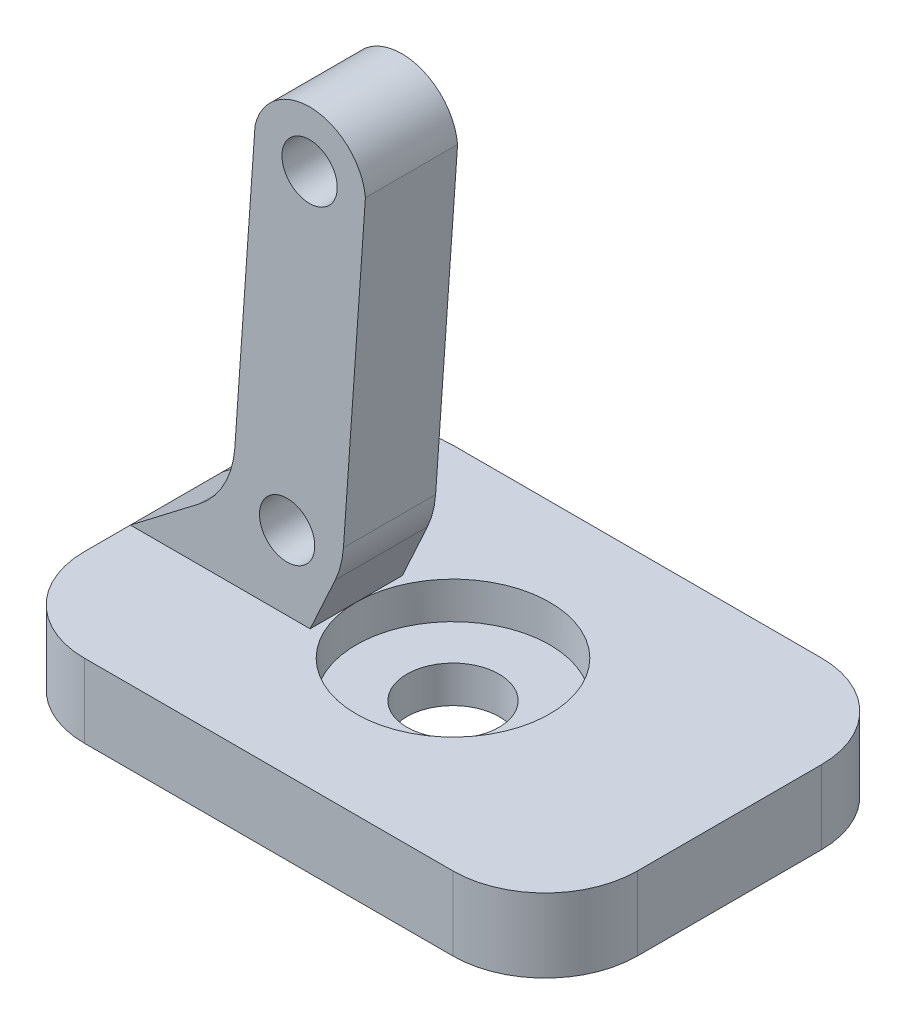
ISO-10303-21;
HEADER;
FILE_DESCRIPTION(('STEP AP214'),'2;1');
FILE_NAME('part.step','',(''),(''),'','','');
FILE_SCHEMA(('AUTOMOTIVE_DESIGN { 1 0 10303 214 1 1 1 1 }'));
ENDSEC;
DATA;
#1=APPLICATION_CONTEXT('core data for automotive mechanical design processes');
#2=APPLICATION_PROTOCOL_DEFINITION('international standard','automotive_design',2000,#1);
#3=PRODUCT_CONTEXT('',#1,'mechanical');
#4=PRODUCT('Part','Part','',(#3));
#5=PRODUCT_RELATED_PRODUCT_CATEGORY('part','',(#4));
#6=PRODUCT_DEFINITION_FORMATION('','',#4);
#7=PRODUCT_DEFINITION_CONTEXT('part definition',#1,'design');
#8=PRODUCT_DEFINITION('design','',#6,#7);
#9=PRODUCT_DEFINITION_SHAPE('','',#8);
#10=(LENGTH_UNIT() NAMED_UNIT(*) SI_UNIT(.MILLI.,.METRE.));
#11=(NAMED_UNIT(*) PLANE_ANGLE_UNIT() SI_UNIT($,.RADIAN.));
#12=(NAMED_UNIT(*) SI_UNIT($,.STERADIAN.) SOLID_ANGLE_UNIT());
#13=UNCERTAINTY_MEASURE_WITH_UNIT(LENGTH_MEASURE(1.E-05),#10,'distance_accuracy_value','');
#14=(GEOMETRIC_REPRESENTATION_CONTEXT(3) GLOBAL_UNCERTAINTY_ASSIGNED_CONTEXT((#13)) GLOBAL_UNIT_ASSIGNED_CONTEXT((#10,
#11,#12)) REPRESENTATION_CONTEXT('',''));
#15=CARTESIAN_POINT('',(0.,0.,0.));
#16=DIRECTION('',(0.,0.,1.));
#17=DIRECTION('',(1.,0.,0.));
#18=AXIS2_PLACEMENT_3D('',#15,#16,#17);
#19=CARTESIAN_POINT('',(0.,4.,0.));
#20=DIRECTION('',(0.,1.,0.));
#21=DIRECTION('',(0.,0.,1.));
#22=AXIS2_PLACEMENT_3D('',#19,#20,#21);
#23=PLANE('',#22);
#24=DIRECTION('',(0.,0.,-1.));
#25=VECTOR('',#24,1.);
#26=CARTESIAN_POINT('',(15.,4.,-10.));
#27=LINE('',#26,#25);
#28=CARTESIAN_POINT('',(15.,4.,5.));
#29=VERTEX_POINT('',#28);
#30=CARTESIAN_POINT('',(15.,4.,-5.));
#31=VERTEX_POINT('',#30);
#32=EDGE_CURVE('E197',#29,#31,#27,.T.);
#33=ORIENTED_EDGE('',*,*,#32,.T.);
#34=CARTESIAN_POINT('',(10.,4.,-5.));
#35=DIRECTION('',(0.,1.,0.));
#36=DIRECTION('',(0.,0.,1.));
#37=AXIS2_PLACEMENT_3D('',#34,#35,#36);
#38=CIRCLE('',#37,5.);
#39=CARTESIAN_POINT('',(10.,4.,-10.));
#40=VERTEX_POINT('',#39);
#41=EDGE_CURVE('E261',#31,#40,#38,.T.);
#42=ORIENTED_EDGE('',*,*,#41,.T.);
#43=DIRECTION('',(-1.,0.,0.));
#44=VECTOR('',#43,1.);
#45=CARTESIAN_POINT('',(-15.,4.,-10.));
#46=LINE('',#45,#44);
#47=CARTESIAN_POINT('',(-10.,4.,-10.));
#48=VERTEX_POINT('',#47);
#49=EDGE_CURVE('E200',#40,#48,#46,.T.);
#50=ORIENTED_EDGE('',*,*,#49,.T.);
#51=CARTESIAN_POINT('',(-10.,4.,-5.));
#52=DIRECTION('',(0.,1.,0.));
#53=DIRECTION('',(0.,0.,1.));
#54=AXIS2_PLACEMENT_3D('',#51,#52,#53);
#55=CIRCLE('',#54,5.);
#56=CARTESIAN_POINT('',(-15.,4.,-5.));
#57=VERTEX_POINT('',#56);
#58=EDGE_CURVE('E257',#48,#57,#55,.T.);
#59=ORIENTED_EDGE('',*,*,#58,.T.);
#60=DIRECTION('',(0.,0.,1.));
#61=VECTOR('',#60,1.);
#62=CARTESIAN_POINT('',(-15.,4.,-10.));
#63=LINE('',#62,#61);
#64=CARTESIAN_POINT('',(-15.,4.,-2.5));
#65=VERTEX_POINT('',#64);
#66=EDGE_CURVE('E205',#57,#65,#63,.T.);
#67=ORIENTED_EDGE('',*,*,#66,.T.);
#68=DIRECTION('',(1.,0.,0.));
#69=VECTOR('',#68,1.);
#70=CARTESIAN_POINT('',(-5.25,4.,-2.5));
#71=LINE('',#70,#69);
#72=CARTESIAN_POINT('',(-5.25,4.,-2.5));
#73=VERTEX_POINT('',#72);
#74=EDGE_CURVE('E306',#65,#73,#71,.T.);
#75=ORIENTED_EDGE('',*,*,#74,.T.);
#76=DIRECTION('',(0.,0.,-1.));
#77=VECTOR('',#76,1.);
#78=CARTESIAN_POINT('',(-5.25,4.,2.5));
#79=LINE('',#78,#77);
#80=CARTESIAN_POINT('',(-5.25,4.,0.));
#81=VERTEX_POINT('',#80);
#82=EDGE_CURVE('E209',#81,#73,#79,.T.);
#83=ORIENTED_EDGE('',*,*,#82,.F.);
#84=CARTESIAN_POINT('',(0.,4.,0.));
#85=DIRECTION('',(0.,1.,0.));
#86=DIRECTION('',(0.,0.,1.));
#87=AXIS2_PLACEMENT_3D('',#84,#85,#86);
#88=CIRCLE('',#87,5.25);
#89=EDGE_CURVE('E194',#81,#81,#88,.T.);
#90=ORIENTED_EDGE('',*,*,#89,.F.);
#91=CARTESIAN_POINT('',(-5.25,4.,2.5));
#92=VERTEX_POINT('',#91);
#93=EDGE_CURVE('E186',#92,#81,#79,.T.);
#94=ORIENTED_EDGE('',*,*,#93,.F.);
#95=DIRECTION('',(1.,0.,0.));
#96=VECTOR('',#95,1.);
#97=CARTESIAN_POINT('',(-5.25,4.,2.5));
#98=LINE('',#97,#96);
#99=CARTESIAN_POINT('',(-15.,4.,2.5));
#100=VERTEX_POINT('',#99);
#101=EDGE_CURVE('E276',#100,#92,#98,.T.);
#102=ORIENTED_EDGE('',*,*,#101,.F.);
#103=CARTESIAN_POINT('',(-15.,4.,5.));
#104=VERTEX_POINT('',#103);
#105=EDGE_CURVE('E204',#100,#104,#63,.T.);
#106=ORIENTED_EDGE('',*,*,#105,.T.);
#107=CARTESIAN_POINT('',(-10.,4.,5.));
#108=DIRECTION('',(0.,1.,0.));
#109=DIRECTION('',(0.,0.,1.));
#110=AXIS2_PLACEMENT_3D('',#107,#108,#109);
#111=CIRCLE('',#110,5.);
#112=CARTESIAN_POINT('',(-10.,4.,10.));
#113=VERTEX_POINT('',#112);
#114=EDGE_CURVE('E55',#104,#113,#111,.T.);
#115=ORIENTED_EDGE('',*,*,#114,.T.);
#116=DIRECTION('',(1.,0.,0.));
#117=VECTOR('',#116,1.);
#118=CARTESIAN_POINT('',(-15.,4.,10.));
#119=LINE('',#118,#117);
#120=CARTESIAN_POINT('',(10.,4.,10.));
#121=VERTEX_POINT('',#120);
#122=EDGE_CURVE('E207',#113,#121,#119,.T.);
#123=ORIENTED_EDGE('',*,*,#122,.T.);
#124=CARTESIAN_POINT('',(10.,4.,5.));
#125=DIRECTION('',(0.,1.,0.));
#126=DIRECTION('',(0.,0.,1.));
#127=AXIS2_PLACEMENT_3D('',#124,#125,#126);
#128=CIRCLE('',#127,5.);
#129=EDGE_CURVE('E259',#121,#29,#128,.T.);
#130=ORIENTED_EDGE('',*,*,#129,.T.);
#131=EDGE_LOOP('',(#33,#42,#50,#59,#67,#75,#83,#90,#94,#102,#106,#115,#123,#130));
#132=FACE_BOUND('',#131,.T.);
#133=ADVANCED_FACE('F33',(#132),#23,.T.);
#134=CARTESIAN_POINT('',(15.,4.,-10.));
#135=DIRECTION('',(-1.,0.,0.));
#136=DIRECTION('',(0.,0.,1.));
#137=AXIS2_PLACEMENT_3D('',#134,#135,#136);
#138=PLANE('',#137);
#139=DIRECTION('',(0.,0.,-1.));
#140=VECTOR('',#139,1.);
#141=CARTESIAN_POINT('',(15.,0.,-10.));
#142=LINE('',#141,#140);
#143=CARTESIAN_POINT('',(15.,0.,5.));
#144=VERTEX_POINT('',#143);
#145=CARTESIAN_POINT('',(15.,0.,-5.));
#146=VERTEX_POINT('',#145);
#147=EDGE_CURVE('E193',#144,#146,#142,.T.);
#148=ORIENTED_EDGE('',*,*,#147,.T.);
#149=DIRECTION('',(0.,-1.,0.));
#150=VECTOR('',#149,1.);
#151=CARTESIAN_POINT('',(15.,4.,-5.));
#152=LINE('',#151,#150);
#153=EDGE_CURVE('E254',#146,#31,#152,.F.);
#154=ORIENTED_EDGE('',*,*,#153,.T.);
#155=ORIENTED_EDGE('',*,*,#32,.F.);
#156=DIRECTION('',(0.,-1.,0.));
#157=VECTOR('',#156,1.);
#158=CARTESIAN_POINT('',(15.,4.,5.));
#159=LINE('',#158,#157);
#160=EDGE_CURVE('E251',#29,#144,#159,.T.);
#161=ORIENTED_EDGE('',*,*,#160,.T.);
#162=EDGE_LOOP('',(#148,#154,#155,#161));
#163=FACE_BOUND('',#162,.T.);
#164=ADVANCED_FACE('F290',(#163),#138,.F.);
#165=CARTESIAN_POINT('',(-15.,4.,-10.));
#166=DIRECTION('',(0.,0.,1.));
#167=DIRECTION('',(1.,0.,0.));
#168=AXIS2_PLACEMENT_3D('',#165,#166,#167);
#169=PLANE('',#168);
#170=ORIENTED_EDGE('',*,*,#49,.F.);
#171=DIRECTION('',(0.,-1.,0.));
#172=VECTOR('',#171,1.);
#173=CARTESIAN_POINT('',(10.,4.,-10.));
#174=LINE('',#173,#172);
#175=CARTESIAN_POINT('',(10.,0.,-10.));
#176=VERTEX_POINT('',#175);
#177=EDGE_CURVE('E240',#40,#176,#174,.T.);
#178=ORIENTED_EDGE('',*,*,#177,.T.);
#179=DIRECTION('',(-1.,0.,0.));
#180=VECTOR('',#179,1.);
#181=CARTESIAN_POINT('',(-15.,0.,-10.));
#182=LINE('',#181,#180);
#183=CARTESIAN_POINT('',(-10.,0.,-10.));
#184=VERTEX_POINT('',#183);
#185=EDGE_CURVE('E212',#176,#184,#182,.T.);
#186=ORIENTED_EDGE('',*,*,#185,.T.);
#187=DIRECTION('',(0.,-1.,0.));
#188=VECTOR('',#187,1.);
#189=CARTESIAN_POINT('',(-10.,4.,-10.));
#190=LINE('',#189,#188);
#191=EDGE_CURVE('E238',#184,#48,#190,.F.);
#192=ORIENTED_EDGE('',*,*,#191,.T.);
#193=EDGE_LOOP('',(#170,#178,#186,#192));
#194=FACE_BOUND('',#193,.T.);
#195=ADVANCED_FACE('F298',(#194),#169,.F.);
#196=CARTESIAN_POINT('',(-15.,4.,-10.));
#197=DIRECTION('',(1.,0.,0.));
#198=DIRECTION('',(0.,0.,-1.));
#199=AXIS2_PLACEMENT_3D('',#196,#197,#198);
#200=PLANE('',#199);
#201=ORIENTED_EDGE('',*,*,#66,.F.);
#202=DIRECTION('',(0.,-1.,0.));
#203=VECTOR('',#202,1.);
#204=CARTESIAN_POINT('',(-15.,4.,-5.));
#205=LINE('',#204,#203);
#206=CARTESIAN_POINT('',(-15.,0.,-5.));
#207=VERTEX_POINT('',#206);
#208=EDGE_CURVE('E11',#57,#207,#205,.T.);
#209=ORIENTED_EDGE('',*,*,#208,.T.);
#210=DIRECTION('',(0.,0.,1.));
#211=VECTOR('',#210,1.);
#212=CARTESIAN_POINT('',(-15.,0.,-10.));
#213=LINE('',#212,#211);
#214=CARTESIAN_POINT('',(-15.,0.,5.));
#215=VERTEX_POINT('',#214);
#216=EDGE_CURVE('E215',#207,#215,#213,.T.);
#217=ORIENTED_EDGE('',*,*,#216,.T.);
#218=DIRECTION('',(0.,-1.,0.));
#219=VECTOR('',#218,1.);
#220=CARTESIAN_POINT('',(-15.,4.,5.));
#221=LINE('',#220,#219);
#222=EDGE_CURVE('E41',#215,#104,#221,.F.);
#223=ORIENTED_EDGE('',*,*,#222,.T.);
#224=ORIENTED_EDGE('',*,*,#105,.F.);
#225=DIRECTION('',(0.,0.,-1.));
#226=VECTOR('',#225,1.);
#227=CARTESIAN_POINT('',(-15.,4.,2.5));
#228=LINE('',#227,#226);
#229=EDGE_CURVE('E180',#100,#65,#228,.T.);
#230=ORIENTED_EDGE('',*,*,#229,.T.);
#231=EDGE_LOOP('',(#201,#209,#217,#223,#224,#230));
#232=FACE_BOUND('',#231,.T.);
#233=ADVANCED_FACE('F270',(#232),#200,.F.);
#234=CARTESIAN_POINT('',(-15.,4.,10.));
#235=DIRECTION('',(0.,0.,-1.));
#236=DIRECTION('',(-1.,0.,0.));
#237=AXIS2_PLACEMENT_3D('',#234,#235,#236);
#238=PLANE('',#237);
#239=DIRECTION('',(1.,0.,0.));
#240=VECTOR('',#239,1.);
#241=CARTESIAN_POINT('',(-15.,0.,10.));
#242=LINE('',#241,#240);
#243=CARTESIAN_POINT('',(-10.,0.,10.));
#244=VERTEX_POINT('',#243);
#245=CARTESIAN_POINT('',(10.,0.,10.));
#246=VERTEX_POINT('',#245);
#247=EDGE_CURVE('E201',#244,#246,#242,.T.);
#248=ORIENTED_EDGE('',*,*,#247,.T.);
#249=DIRECTION('',(0.,-1.,0.));
#250=VECTOR('',#249,1.);
#251=CARTESIAN_POINT('',(10.,4.,10.));
#252=LINE('',#251,#250);
#253=EDGE_CURVE('E48',#246,#121,#252,.F.);
#254=ORIENTED_EDGE('',*,*,#253,.T.);
#255=ORIENTED_EDGE('',*,*,#122,.F.);
#256=DIRECTION('',(0.,-1.,0.));
#257=VECTOR('',#256,1.);
#258=CARTESIAN_POINT('',(-10.,4.,10.));
#259=LINE('',#258,#257);
#260=EDGE_CURVE('E263',#113,#244,#259,.T.);
#261=ORIENTED_EDGE('',*,*,#260,.T.);
#262=EDGE_LOOP('',(#248,#254,#255,#261));
#263=FACE_BOUND('',#262,.T.);
#264=ADVANCED_FACE('F279',(#263),#238,.F.);
#265=CARTESIAN_POINT('',(0.,0.,0.));
#266=DIRECTION('',(0.,1.,0.));
#267=DIRECTION('',(0.,0.,1.));
#268=AXIS2_PLACEMENT_3D('',#265,#266,#267);
#269=PLANE('',#268);
#270=CARTESIAN_POINT('',(0.,0.,0.));
#271=DIRECTION('',(0.,1.,0.));
#272=DIRECTION('',(0.,0.,1.));
#273=AXIS2_PLACEMENT_3D('',#270,#271,#272);
#274=CIRCLE('',#273,2.5);
#275=CARTESIAN_POINT('',(0.,0.,2.5));
#276=VERTEX_POINT('',#275);
#277=EDGE_CURVE('E179',#276,#276,#274,.T.);
#278=ORIENTED_EDGE('',*,*,#277,.T.);
#279=EDGE_LOOP('',(#278));
#280=FACE_BOUND('',#279,.T.);
#281=ORIENTED_EDGE('',*,*,#185,.F.);
#282=CARTESIAN_POINT('',(10.,0.,-5.));
#283=DIRECTION('',(0.,1.,0.));
#284=DIRECTION('',(0.,0.,1.));
#285=AXIS2_PLACEMENT_3D('',#282,#283,#284);
#286=CIRCLE('',#285,5.);
#287=EDGE_CURVE('E249',#176,#146,#286,.F.);
#288=ORIENTED_EDGE('',*,*,#287,.T.);
#289=ORIENTED_EDGE('',*,*,#147,.F.);
#290=CARTESIAN_POINT('',(10.,0.,5.));
#291=DIRECTION('',(0.,1.,0.));
#292=DIRECTION('',(0.,0.,1.));
#293=AXIS2_PLACEMENT_3D('',#290,#291,#292);
#294=CIRCLE('',#293,5.);
#295=EDGE_CURVE('E247',#144,#246,#294,.F.);
#296=ORIENTED_EDGE('',*,*,#295,.T.);
#297=ORIENTED_EDGE('',*,*,#247,.F.);
#298=CARTESIAN_POINT('',(-10.,0.,5.));
#299=DIRECTION('',(0.,1.,0.));
#300=DIRECTION('',(0.,0.,1.));
#301=AXIS2_PLACEMENT_3D('',#298,#299,#300);
#302=CIRCLE('',#301,5.);
#303=EDGE_CURVE('E243',#244,#215,#302,.F.);
#304=ORIENTED_EDGE('',*,*,#303,.T.);
#305=ORIENTED_EDGE('',*,*,#216,.F.);
#306=CARTESIAN_POINT('',(-10.,0.,-5.));
#307=DIRECTION('',(0.,1.,0.));
#308=DIRECTION('',(0.,0.,1.));
#309=AXIS2_PLACEMENT_3D('',#306,#307,#308);
#310=CIRCLE('',#309,5.);
#311=EDGE_CURVE('E245',#207,#184,#310,.F.);
#312=ORIENTED_EDGE('',*,*,#311,.T.);
#313=EDGE_LOOP('',(#281,#288,#289,#296,#297,#304,#305,#312));
#314=FACE_BOUND('',#313,.T.);
#315=ADVANCED_FACE('F282',(#280,#314),#269,.F.);
#316=CARTESIAN_POINT('',(0.,2.,0.));
#317=DIRECTION('',(0.,1.,0.));
#318=DIRECTION('',(0.,0.,1.));
#319=AXIS2_PLACEMENT_3D('',#316,#317,#318);
#320=CYLINDRICAL_SURFACE('',#319,5.25);
#321=CARTESIAN_POINT('',(0.,2.,0.));
#322=DIRECTION('',(0.,1.,0.));
#323=DIRECTION('',(0.,0.,1.));
#324=AXIS2_PLACEMENT_3D('',#321,#322,#323);
#325=CIRCLE('',#324,5.25);
#326=CARTESIAN_POINT('',(0.,2.,5.25));
#327=VERTEX_POINT('',#326);
#328=EDGE_CURVE('E190',#327,#327,#325,.T.);
#329=ORIENTED_EDGE('',*,*,#328,.F.);
#330=EDGE_LOOP('',(#329));
#331=FACE_BOUND('',#330,.T.);
#332=ORIENTED_EDGE('',*,*,#89,.T.);
#333=EDGE_LOOP('',(#332));
#334=FACE_BOUND('',#333,.T.);
#335=ADVANCED_FACE('F378',(#331,#334),#320,.F.);
#336=CARTESIAN_POINT('',(0.,2.,0.));
#337=DIRECTION('',(0.,1.,0.));
#338=DIRECTION('',(0.,0.,1.));
#339=AXIS2_PLACEMENT_3D('',#336,#337,#338);
#340=PLANE('',#339);
#341=CARTESIAN_POINT('',(0.,2.,0.));
#342=DIRECTION('',(0.,1.,0.));
#343=DIRECTION('',(0.,0.,1.));
#344=AXIS2_PLACEMENT_3D('',#341,#342,#343);
#345=CIRCLE('',#344,2.5);
#346=CARTESIAN_POINT('',(0.,2.,2.5));
#347=VERTEX_POINT('',#346);
#348=EDGE_CURVE('E183',#347,#347,#345,.T.);
#349=ORIENTED_EDGE('',*,*,#348,.F.);
#350=EDGE_LOOP('',(#349));
#351=FACE_BOUND('',#350,.T.);
#352=ORIENTED_EDGE('',*,*,#328,.T.);
#353=EDGE_LOOP('',(#352));
#354=FACE_BOUND('',#353,.T.);
#355=ADVANCED_FACE('F411',(#351,#354),#340,.T.);
#356=CARTESIAN_POINT('',(0.,0.,0.));
#357=DIRECTION('',(0.,1.,0.));
#358=DIRECTION('',(0.,0.,1.));
#359=AXIS2_PLACEMENT_3D('',#356,#357,#358);
#360=CYLINDRICAL_SURFACE('',#359,2.5);
#361=ORIENTED_EDGE('',*,*,#348,.T.);
#362=EDGE_LOOP('',(#361));
#363=FACE_BOUND('',#362,.T.);
#364=ORIENTED_EDGE('',*,*,#277,.F.);
#365=EDGE_LOOP('',(#364));
#366=FACE_BOUND('',#365,.T.);
#367=ADVANCED_FACE('F420',(#363,#366),#360,.F.);
#368=CARTESIAN_POINT('',(-5.2792617094778,25.4669020815353,2.5));
#369=DIRECTION('',(0.,0.,-1.));
#370=DIRECTION('',(-1.,0.,0.));
#371=AXIS2_PLACEMENT_3D('',#368,#369,#370);
#372=PLANE('',#371);
#373=DIRECTION('',(0.416833689176245,0.908982769675928,0.));
#374=VECTOR('',#373,1.);
#375=CARTESIAN_POINT('',(-3.50730784922053,7.80026178075603,2.5));
#376=LINE('',#375,#374);
#377=CARTESIAN_POINT('',(-3.88672018419393,6.97288317857325,2.5));
#378=VERTEX_POINT('',#377);
#379=EDGE_CURVE('E342',#92,#378,#376,.T.);
#380=ORIENTED_EDGE('',*,*,#379,.T.);
#381=CARTESIAN_POINT('',(-8.43163403257358,9.05705162445447,2.5));
#382=DIRECTION('',(0.,0.,-1.));
#383=DIRECTION('',(-1.,0.,0.));
#384=AXIS2_PLACEMENT_3D('',#381,#382,#383);
#385=CIRCLE('',#384,5.);
#386=CARTESIAN_POINT('',(-3.44381378127446,8.70826925573384,2.5));
#387=VERTEX_POINT('',#386);
#388=EDGE_CURVE('E228',#378,#387,#385,.F.);
#389=ORIENTED_EDGE('',*,*,#388,.T.);
#390=DIRECTION('',(0.0697564737441259,0.997564050259824,0.));
#391=VECTOR('',#390,1.);
#392=CARTESIAN_POINT('',(-2.25186124509036,25.7539846695438,2.5));
#393=LINE('',#392,#391);
#394=CARTESIAN_POINT('',(-2.25186124509036,25.7539846695438,2.5));
#395=VERTEX_POINT('',#394);
#396=EDGE_CURVE('E170',#387,#395,#393,.T.);
#397=ORIENTED_EDGE('',*,*,#396,.T.);
#398=CARTESIAN_POINT('',(-5.2792617094778,25.4669020815353,2.5));
#399=DIRECTION('',(0.,0.,1.));
#400=DIRECTION('',(-1.,0.,0.));
#401=AXIS2_PLACEMENT_3D('',#398,#399,#400);
#402=CIRCLE('',#401,3.04098174675728);
#403=CARTESIAN_POINT('',(-8.23724554664931,26.1725235120086,2.5));
#404=VERTEX_POINT('',#403);
#405=EDGE_CURVE('E163',#395,#404,#402,.T.);
#406=ORIENTED_EDGE('',*,*,#405,.T.);
#407=DIRECTION('',(-0.0697564737441252,-0.997564050259824,0.));
#408=VECTOR('',#407,1.);
#409=CARTESIAN_POINT('',(-9.49269215077947,8.21880062322078,2.5));
#410=LINE('',#409,#408);
#411=CARTESIAN_POINT('',(-9.33540666367515,10.468087881324,2.5));
#412=VERTEX_POINT('',#411);
#413=EDGE_CURVE('E151',#404,#412,#410,.T.);
#414=ORIENTED_EDGE('',*,*,#413,.T.);
#415=CARTESIAN_POINT('',(-14.3232269149743,10.8168702500446,2.5));
#416=DIRECTION('',(0.,0.,-1.));
#417=DIRECTION('',(-1.,0.,0.));
#418=AXIS2_PLACEMENT_3D('',#415,#416,#417);
#419=CIRCLE('',#418,5.);
#420=CARTESIAN_POINT('',(-11.2826439568432,6.8476316234661,2.5));
#421=VERTEX_POINT('',#420);
#422=EDGE_CURVE('E236',#412,#421,#419,.T.);
#423=ORIENTED_EDGE('',*,*,#422,.T.);
#424=DIRECTION('',(-0.793847725315703,-0.608116591626215,0.));
#425=VECTOR('',#424,1.);
#426=CARTESIAN_POINT('',(-15.,4.,2.5));
#427=LINE('',#426,#425);
#428=EDGE_CURVE('E162',#421,#100,#427,.T.);
#429=ORIENTED_EDGE('',*,*,#428,.T.);
#430=ORIENTED_EDGE('',*,*,#101,.T.);
#431=EDGE_LOOP('',(#380,#389,#397,#406,#414,#423,#429,#430));
#432=FACE_BOUND('',#431,.T.);
#433=CARTESIAN_POINT('',(-6.5,8.00953120198841,2.5));
#434=DIRECTION('',(0.,0.,1.));
#435=DIRECTION('',(1.,0.,0.));
#436=AXIS2_PLACEMENT_3D('',#433,#434,#435);
#437=CIRCLE('',#436,1.5);
#438=CARTESIAN_POINT('',(-5.,8.00953120198841,2.5));
#439=VERTEX_POINT('',#438);
#440=EDGE_CURVE('E346',#439,#439,#437,.T.);
#441=ORIENTED_EDGE('',*,*,#440,.F.);
#442=EDGE_LOOP('',(#441));
#443=FACE_BOUND('',#442,.T.);
#444=CARTESIAN_POINT('',(-5.2792617094778,25.4669020815353,2.5));
#445=DIRECTION('',(0.,0.,1.));
#446=DIRECTION('',(1.,0.,0.));
#447=AXIS2_PLACEMENT_3D('',#444,#445,#446);
#448=CIRCLE('',#447,1.5);
#449=CARTESIAN_POINT('',(-3.7792617094778,25.4669020815353,2.5));
#450=VERTEX_POINT('',#449);
#451=EDGE_CURVE('E353',#450,#450,#448,.T.);
#452=ORIENTED_EDGE('',*,*,#451,.F.);
#453=EDGE_LOOP('',(#452));
#454=FACE_BOUND('',#453,.T.);
#455=ADVANCED_FACE('F167',(#432,#443,#454),#372,.F.);
#456=CARTESIAN_POINT('',(-5.2792617094778,25.4669020815353,-2.5));
#457=DIRECTION('',(0.,0.,-1.));
#458=DIRECTION('',(-1.,0.,0.));
#459=AXIS2_PLACEMENT_3D('',#456,#457,#458);
#460=PLANE('',#459);
#461=CARTESIAN_POINT('',(-6.5,8.00953120198841,-2.5));
#462=DIRECTION('',(0.,0.,1.));
#463=DIRECTION('',(1.,0.,0.));
#464=AXIS2_PLACEMENT_3D('',#461,#462,#463);
#465=CIRCLE('',#464,1.5);
#466=CARTESIAN_POINT('',(-5.,8.00953120198841,-2.5));
#467=VERTEX_POINT('',#466);
#468=EDGE_CURVE('E348',#467,#467,#465,.T.);
#469=ORIENTED_EDGE('',*,*,#468,.T.);
#470=EDGE_LOOP('',(#469));
#471=FACE_BOUND('',#470,.T.);
#472=DIRECTION('',(0.0697564737441259,0.997564050259824,0.));
#473=VECTOR('',#472,1.);
#474=CARTESIAN_POINT('',(-2.25186124509036,25.7539846695438,-2.5));
#475=LINE('',#474,#473);
#476=CARTESIAN_POINT('',(-3.44381378127446,8.70826925573384,-2.5));
#477=VERTEX_POINT('',#476);
#478=CARTESIAN_POINT('',(-2.25186124509036,25.7539846695438,-2.5));
#479=VERTEX_POINT('',#478);
#480=EDGE_CURVE('E174',#477,#479,#475,.T.);
#481=ORIENTED_EDGE('',*,*,#480,.F.);
#482=CARTESIAN_POINT('',(-8.43163403257358,9.05705162445447,-2.5));
#483=DIRECTION('',(0.,0.,-1.));
#484=DIRECTION('',(-1.,0.,0.));
#485=AXIS2_PLACEMENT_3D('',#482,#483,#484);
#486=CIRCLE('',#485,5.);
#487=CARTESIAN_POINT('',(-3.88672018419393,6.97288317857325,-2.5));
#488=VERTEX_POINT('',#487);
#489=EDGE_CURVE('E224',#477,#488,#486,.T.);
#490=ORIENTED_EDGE('',*,*,#489,.T.);
#491=DIRECTION('',(0.416833689176245,0.908982769675928,0.));
#492=VECTOR('',#491,1.);
#493=CARTESIAN_POINT('',(-3.50730784922053,7.80026178075603,-2.5));
#494=LINE('',#493,#492);
#495=EDGE_CURVE('E317',#73,#488,#494,.T.);
#496=ORIENTED_EDGE('',*,*,#495,.F.);
#497=ORIENTED_EDGE('',*,*,#74,.F.);
#498=DIRECTION('',(-0.793847725315703,-0.608116591626215,0.));
#499=VECTOR('',#498,1.);
#500=CARTESIAN_POINT('',(-15.,4.,-2.5));
#501=LINE('',#500,#499);
#502=CARTESIAN_POINT('',(-11.2826439568432,6.8476316234661,-2.5));
#503=VERTEX_POINT('',#502);
#504=EDGE_CURVE('E310',#503,#65,#501,.T.);
#505=ORIENTED_EDGE('',*,*,#504,.F.);
#506=CARTESIAN_POINT('',(-14.3232269149743,10.8168702500446,-2.5));
#507=DIRECTION('',(0.,0.,-1.));
#508=DIRECTION('',(-1.,0.,0.));
#509=AXIS2_PLACEMENT_3D('',#506,#507,#508);
#510=CIRCLE('',#509,5.);
#511=CARTESIAN_POINT('',(-9.33540666367515,10.468087881324,-2.5));
#512=VERTEX_POINT('',#511);
#513=EDGE_CURVE('E234',#503,#512,#510,.F.);
#514=ORIENTED_EDGE('',*,*,#513,.T.);
#515=DIRECTION('',(-0.0697564737441252,-0.997564050259824,0.));
#516=VECTOR('',#515,1.);
#517=CARTESIAN_POINT('',(-9.49269215077947,8.21880062322078,-2.5));
#518=LINE('',#517,#516);
#519=CARTESIAN_POINT('',(-8.23724554664931,26.1725235120086,-2.5));
#520=VERTEX_POINT('',#519);
#521=EDGE_CURVE('E315',#520,#512,#518,.T.);
#522=ORIENTED_EDGE('',*,*,#521,.F.);
#523=CARTESIAN_POINT('',(-5.2792617094778,25.4669020815353,-2.5));
#524=DIRECTION('',(0.,0.,1.));
#525=DIRECTION('',(-1.,0.,0.));
#526=AXIS2_PLACEMENT_3D('',#523,#524,#525);
#527=CIRCLE('',#526,3.04098174675728);
#528=EDGE_CURVE('E178',#479,#520,#527,.T.);
#529=ORIENTED_EDGE('',*,*,#528,.F.);
#530=EDGE_LOOP('',(#481,#490,#496,#497,#505,#514,#522,#529));
#531=FACE_BOUND('',#530,.T.);
#532=CARTESIAN_POINT('',(-5.2792617094778,25.4669020815353,-2.5));
#533=DIRECTION('',(0.,0.,1.));
#534=DIRECTION('',(1.,0.,0.));
#535=AXIS2_PLACEMENT_3D('',#532,#533,#534);
#536=CIRCLE('',#535,1.5);
#537=CARTESIAN_POINT('',(-3.7792617094778,25.4669020815353,-2.5));
#538=VERTEX_POINT('',#537);
#539=EDGE_CURVE('E356',#538,#538,#536,.T.);
#540=ORIENTED_EDGE('',*,*,#539,.T.);
#541=EDGE_LOOP('',(#540));
#542=FACE_BOUND('',#541,.T.);
#543=ADVANCED_FACE('F334',(#471,#531,#542),#460,.T.);
#544=CARTESIAN_POINT('',(-5.2792617094778,25.4669020815353,2.5));
#545=DIRECTION('',(0.,0.,-1.));
#546=DIRECTION('',(-1.,0.,0.));
#547=AXIS2_PLACEMENT_3D('',#544,#545,#546);
#548=CYLINDRICAL_SURFACE('',#547,3.04098174675728);
#549=ORIENTED_EDGE('',*,*,#528,.T.);
#550=DIRECTION('',(0.,0.,-1.));
#551=VECTOR('',#550,1.);
#552=CARTESIAN_POINT('',(-8.23724554664931,26.1725235120086,2.5));
#553=LINE('',#552,#551);
#554=EDGE_CURVE('E156',#404,#520,#553,.T.);
#555=ORIENTED_EDGE('',*,*,#554,.F.);
#556=ORIENTED_EDGE('',*,*,#405,.F.);
#557=DIRECTION('',(0.,0.,-1.));
#558=VECTOR('',#557,1.);
#559=CARTESIAN_POINT('',(-2.25186124509036,25.7539846695438,2.5));
#560=LINE('',#559,#558);
#561=EDGE_CURVE('E325',#395,#479,#560,.T.);
#562=ORIENTED_EDGE('',*,*,#561,.T.);
#563=EDGE_LOOP('',(#549,#555,#556,#562));
#564=FACE_BOUND('',#563,.T.);
#565=ADVANCED_FACE('F176',(#564),#548,.T.);
#566=CARTESIAN_POINT('',(-9.49269215077947,8.21880062322078,2.5));
#567=DIRECTION('',(0.997564050259824,-0.0697564737441252,0.));
#568=DIRECTION('',(0.0697564737441252,0.997564050259824,0.));
#569=AXIS2_PLACEMENT_3D('',#566,#567,#568);
#570=PLANE('',#569);
#571=ORIENTED_EDGE('',*,*,#521,.T.);
#572=DIRECTION('',(0.,0.,-1.));
#573=VECTOR('',#572,1.);
#574=CARTESIAN_POINT('',(-9.33540666367515,10.468087881324,2.5));
#575=LINE('',#574,#573);
#576=EDGE_CURVE('E159',#512,#412,#575,.F.);
#577=ORIENTED_EDGE('',*,*,#576,.T.);
#578=ORIENTED_EDGE('',*,*,#413,.F.);
#579=ORIENTED_EDGE('',*,*,#554,.T.);
#580=EDGE_LOOP('',(#571,#577,#578,#579));
#581=FACE_BOUND('',#580,.T.);
#582=ADVANCED_FACE('F154',(#581),#570,.F.);
#583=CARTESIAN_POINT('',(-15.,4.,2.5));
#584=DIRECTION('',(0.608116591626215,-0.793847725315703,0.));
#585=DIRECTION('',(0.793847725315703,0.608116591626215,0.));
#586=AXIS2_PLACEMENT_3D('',#583,#584,#585);
#587=PLANE('',#586);
#588=ORIENTED_EDGE('',*,*,#428,.F.);
#589=DIRECTION('',(0.,0.,-1.));
#590=VECTOR('',#589,1.);
#591=CARTESIAN_POINT('',(-11.2826439568432,6.8476316234661,-2.5));
#592=LINE('',#591,#590);
#593=EDGE_CURVE('E230',#421,#503,#592,.T.);
#594=ORIENTED_EDGE('',*,*,#593,.T.);
#595=ORIENTED_EDGE('',*,*,#504,.T.);
#596=ORIENTED_EDGE('',*,*,#229,.F.);
#597=EDGE_LOOP('',(#588,#594,#595,#596));
#598=FACE_BOUND('',#597,.T.);
#599=ADVANCED_FACE('F312',(#598),#587,.F.);
#600=CARTESIAN_POINT('',(-3.50730784922053,7.80026178075603,2.5));
#601=DIRECTION('',(-0.908982769675928,0.416833689176245,0.));
#602=DIRECTION('',(-0.416833689176245,-0.908982769675928,0.));
#603=AXIS2_PLACEMENT_3D('',#600,#601,#602);
#604=PLANE('',#603);
#605=ORIENTED_EDGE('',*,*,#495,.T.);
#606=DIRECTION('',(0.,0.,-1.));
#607=VECTOR('',#606,1.);
#608=CARTESIAN_POINT('',(-3.88672018419393,6.97288317857325,2.5));
#609=LINE('',#608,#607);
#610=EDGE_CURVE('E226',#488,#378,#609,.F.);
#611=ORIENTED_EDGE('',*,*,#610,.T.);
#612=ORIENTED_EDGE('',*,*,#379,.F.);
#613=ORIENTED_EDGE('',*,*,#93,.T.);
#614=ORIENTED_EDGE('',*,*,#82,.T.);
#615=EDGE_LOOP('',(#605,#611,#612,#613,#614));
#616=FACE_BOUND('',#615,.T.);
#617=ADVANCED_FACE('F330',(#616),#604,.F.);
#618=CARTESIAN_POINT('',(-2.25186124509036,25.7539846695438,2.5));
#619=DIRECTION('',(-0.997564050259824,0.0697564737441259,0.));
#620=DIRECTION('',(-0.0697564737441259,-0.997564050259824,0.));
#621=AXIS2_PLACEMENT_3D('',#618,#619,#620);
#622=PLANE('',#621);
#623=ORIENTED_EDGE('',*,*,#396,.F.);
#624=DIRECTION('',(0.,0.,-1.));
#625=VECTOR('',#624,1.);
#626=CARTESIAN_POINT('',(-3.44381378127446,8.70826925573384,2.5));
#627=LINE('',#626,#625);
#628=EDGE_CURVE('E221',#387,#477,#627,.T.);
#629=ORIENTED_EDGE('',*,*,#628,.T.);
#630=ORIENTED_EDGE('',*,*,#480,.T.);
#631=ORIENTED_EDGE('',*,*,#561,.F.);
#632=EDGE_LOOP('',(#623,#629,#630,#631));
#633=FACE_BOUND('',#632,.T.);
#634=ADVANCED_FACE('F341',(#633),#622,.F.);
#635=CARTESIAN_POINT('',(-6.5,8.00953120198841,2.5));
#636=DIRECTION('',(0.,0.,-1.));
#637=DIRECTION('',(-1.,0.,0.));
#638=AXIS2_PLACEMENT_3D('',#635,#636,#637);
#639=CYLINDRICAL_SURFACE('',#638,1.5);
#640=ORIENTED_EDGE('',*,*,#440,.T.);
#641=EDGE_LOOP('',(#640));
#642=FACE_BOUND('',#641,.T.);
#643=ORIENTED_EDGE('',*,*,#468,.F.);
#644=EDGE_LOOP('',(#643));
#645=FACE_BOUND('',#644,.T.);
#646=ADVANCED_FACE('F471',(#642,#645),#639,.F.);
#647=CARTESIAN_POINT('',(-5.2792617094778,25.4669020815353,2.5));
#648=DIRECTION('',(0.,0.,-1.));
#649=DIRECTION('',(-1.,0.,0.));
#650=AXIS2_PLACEMENT_3D('',#647,#648,#649);
#651=CYLINDRICAL_SURFACE('',#650,1.5);
#652=ORIENTED_EDGE('',*,*,#451,.T.);
#653=EDGE_LOOP('',(#652));
#654=FACE_BOUND('',#653,.T.);
#655=ORIENTED_EDGE('',*,*,#539,.F.);
#656=EDGE_LOOP('',(#655));
#657=FACE_BOUND('',#656,.T.);
#658=ADVANCED_FACE('F368',(#654,#657),#651,.F.);
#659=CARTESIAN_POINT('',(-8.43163403257358,9.05705162445447,2.5));
#660=DIRECTION('',(0.,0.,-1.));
#661=DIRECTION('',(-1.,0.,0.));
#662=AXIS2_PLACEMENT_3D('',#659,#660,#661);
#663=CYLINDRICAL_SURFACE('',#662,5.);
#664=ORIENTED_EDGE('',*,*,#388,.F.);
#665=ORIENTED_EDGE('',*,*,#610,.F.);
#666=ORIENTED_EDGE('',*,*,#489,.F.);
#667=ORIENTED_EDGE('',*,*,#628,.F.);
#668=EDGE_LOOP('',(#664,#665,#666,#667));
#669=FACE_BOUND('',#668,.T.);
#670=ADVANCED_FACE('F339',(#669),#663,.T.);
#671=CARTESIAN_POINT('',(-14.3232269149743,10.8168702500446,2.5));
#672=DIRECTION('',(0.,0.,1.));
#673=DIRECTION('',(1.,0.,0.));
#674=AXIS2_PLACEMENT_3D('',#671,#672,#673);
#675=CYLINDRICAL_SURFACE('',#674,5.);
#676=ORIENTED_EDGE('',*,*,#422,.F.);
#677=ORIENTED_EDGE('',*,*,#576,.F.);
#678=ORIENTED_EDGE('',*,*,#513,.F.);
#679=ORIENTED_EDGE('',*,*,#593,.F.);
#680=EDGE_LOOP('',(#676,#677,#678,#679));
#681=FACE_BOUND('',#680,.T.);
#682=ADVANCED_FACE('F360',(#681),#675,.F.);
#683=CARTESIAN_POINT('',(10.,4.,-5.));
#684=DIRECTION('',(0.,-1.,0.));
#685=DIRECTION('',(0.,0.,-1.));
#686=AXIS2_PLACEMENT_3D('',#683,#684,#685);
#687=CYLINDRICAL_SURFACE('',#686,5.);
#688=ORIENTED_EDGE('',*,*,#41,.F.);
#689=ORIENTED_EDGE('',*,*,#153,.F.);
#690=ORIENTED_EDGE('',*,*,#287,.F.);
#691=ORIENTED_EDGE('',*,*,#177,.F.);
#692=EDGE_LOOP('',(#688,#689,#690,#691));
#693=FACE_BOUND('',#692,.T.);
#694=ADVANCED_FACE('F296',(#693),#687,.T.);
#695=CARTESIAN_POINT('',(10.,4.,5.));
#696=DIRECTION('',(0.,-1.,0.));
#697=DIRECTION('',(0.,0.,-1.));
#698=AXIS2_PLACEMENT_3D('',#695,#696,#697);
#699=CYLINDRICAL_SURFACE('',#698,5.);
#700=ORIENTED_EDGE('',*,*,#129,.F.);
#701=ORIENTED_EDGE('',*,*,#253,.F.);
#702=ORIENTED_EDGE('',*,*,#295,.F.);
#703=ORIENTED_EDGE('',*,*,#160,.F.);
#704=EDGE_LOOP('',(#700,#701,#702,#703));
#705=FACE_BOUND('',#704,.T.);
#706=ADVANCED_FACE('F287',(#705),#699,.T.);
#707=CARTESIAN_POINT('',(-10.,4.,-5.));
#708=DIRECTION('',(0.,-1.,0.));
#709=DIRECTION('',(0.,0.,-1.));
#710=AXIS2_PLACEMENT_3D('',#707,#708,#709);
#711=CYLINDRICAL_SURFACE('',#710,5.);
#712=ORIENTED_EDGE('',*,*,#58,.F.);
#713=ORIENTED_EDGE('',*,*,#191,.F.);
#714=ORIENTED_EDGE('',*,*,#311,.F.);
#715=ORIENTED_EDGE('',*,*,#208,.F.);
#716=EDGE_LOOP('',(#712,#713,#714,#715));
#717=FACE_BOUND('',#716,.T.);
#718=ADVANCED_FACE('F303',(#717),#711,.T.);
#719=CARTESIAN_POINT('',(-10.,4.,5.));
#720=DIRECTION('',(0.,-1.,0.));
#721=DIRECTION('',(0.,0.,-1.));
#722=AXIS2_PLACEMENT_3D('',#719,#720,#721);
#723=CYLINDRICAL_SURFACE('',#722,5.);
#724=ORIENTED_EDGE('',*,*,#114,.F.);
#725=ORIENTED_EDGE('',*,*,#222,.F.);
#726=ORIENTED_EDGE('',*,*,#303,.F.);
#727=ORIENTED_EDGE('',*,*,#260,.F.);
#728=EDGE_LOOP('',(#724,#725,#726,#727));
#729=FACE_BOUND('',#728,.T.);
#730=ADVANCED_FACE('F35',(#729),#723,.T.);
#731=CLOSED_SHELL('',(#133,#164,#195,#233,#264,#315,#335,#355,#367,#455,#543,#565,#582,#599,
#617,#634,#646,#658,#670,#682,#694,#706,#718,#730));
#732=MANIFOLD_SOLID_BREP('B2',#731);
#733=ADVANCED_BREP_SHAPE_REPRESENTATION('',(#18,#732),#14);
#734=SHAPE_DEFINITION_REPRESENTATION(#9,#733);
ENDSEC;
END-ISO-10303-21;
